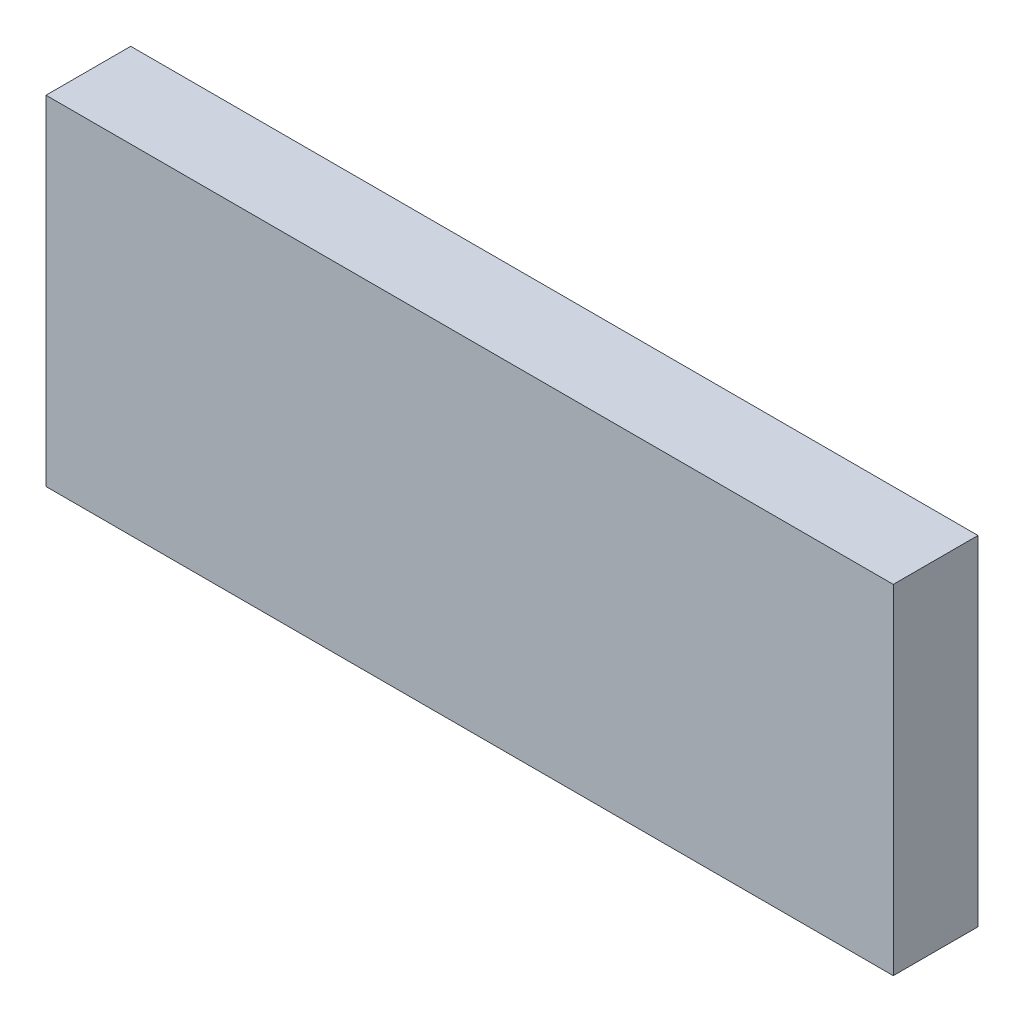
ISO-10303-21;
HEADER;
FILE_DESCRIPTION(('STEP AP214'),'2;1');
FILE_NAME('part.step','',(''),(''),'','','');
FILE_SCHEMA(('AUTOMOTIVE_DESIGN { 1 0 10303 214 1 1 1 1 }'));
ENDSEC;
DATA;
#1=APPLICATION_CONTEXT('core data for automotive mechanical design processes');
#2=APPLICATION_PROTOCOL_DEFINITION('international standard','automotive_design',2000,#1);
#3=PRODUCT_CONTEXT('',#1,'mechanical');
#4=PRODUCT('Part','Part','',(#3));
#5=PRODUCT_RELATED_PRODUCT_CATEGORY('part','',(#4));
#6=PRODUCT_DEFINITION_FORMATION('','',#4);
#7=PRODUCT_DEFINITION_CONTEXT('part definition',#1,'design');
#8=PRODUCT_DEFINITION('design','',#6,#7);
#9=PRODUCT_DEFINITION_SHAPE('','',#8);
#10=(LENGTH_UNIT() NAMED_UNIT(*) SI_UNIT(.MILLI.,.METRE.));
#11=(NAMED_UNIT(*) PLANE_ANGLE_UNIT() SI_UNIT($,.RADIAN.));
#12=(NAMED_UNIT(*) SI_UNIT($,.STERADIAN.) SOLID_ANGLE_UNIT());
#13=UNCERTAINTY_MEASURE_WITH_UNIT(LENGTH_MEASURE(1.E-05),#10,'distance_accuracy_value','');
#14=(GEOMETRIC_REPRESENTATION_CONTEXT(3) GLOBAL_UNCERTAINTY_ASSIGNED_CONTEXT((#13)) GLOBAL_UNIT_ASSIGNED_CONTEXT((#10,
#11,#12)) REPRESENTATION_CONTEXT('',''));
#15=CARTESIAN_POINT('',(0.,0.,0.));
#16=DIRECTION('',(0.,0.,1.));
#17=DIRECTION('',(1.,0.,0.));
#18=AXIS2_PLACEMENT_3D('',#15,#16,#17);
#19=CARTESIAN_POINT('',(50.,20.,10.));
#20=DIRECTION('',(-1.,0.,0.));
#21=DIRECTION('',(0.,0.,1.));
#22=AXIS2_PLACEMENT_3D('',#19,#20,#21);
#23=PLANE('',#22);
#24=DIRECTION('',(0.,1.,0.));
#25=VECTOR('',#24,1.);
#26=CARTESIAN_POINT('',(50.,20.,0.));
#27=LINE('',#26,#25);
#28=CARTESIAN_POINT('',(50.,-20.,0.));
#29=VERTEX_POINT('',#28);
#30=CARTESIAN_POINT('',(50.,20.,0.));
#31=VERTEX_POINT('',#30);
#32=EDGE_CURVE('E97',#29,#31,#27,.T.);
#33=ORIENTED_EDGE('',*,*,#32,.T.);
#34=DIRECTION('',(0.,0.,-1.));
#35=VECTOR('',#34,1.);
#36=CARTESIAN_POINT('',(50.,20.,10.));
#37=LINE('',#36,#35);
#38=CARTESIAN_POINT('',(50.,20.,10.));
#39=VERTEX_POINT('',#38);
#40=EDGE_CURVE('E11',#39,#31,#37,.T.);
#41=ORIENTED_EDGE('',*,*,#40,.F.);
#42=DIRECTION('',(0.,1.,0.));
#43=VECTOR('',#42,1.);
#44=CARTESIAN_POINT('',(50.,20.,10.));
#45=LINE('',#44,#43);
#46=CARTESIAN_POINT('',(50.,-20.,10.));
#47=VERTEX_POINT('',#46);
#48=EDGE_CURVE('E85',#47,#39,#45,.T.);
#49=ORIENTED_EDGE('',*,*,#48,.F.);
#50=DIRECTION('',(0.,0.,-1.));
#51=VECTOR('',#50,1.);
#52=CARTESIAN_POINT('',(50.,-20.,10.));
#53=LINE('',#52,#51);
#54=EDGE_CURVE('E93',#47,#29,#53,.T.);
#55=ORIENTED_EDGE('',*,*,#54,.T.);
#56=EDGE_LOOP('',(#33,#41,#49,#55));
#57=FACE_BOUND('',#56,.T.);
#58=ADVANCED_FACE('F34',(#57),#23,.F.);
#59=CARTESIAN_POINT('',(-50.,20.,10.));
#60=DIRECTION('',(0.,-1.,0.));
#61=DIRECTION('',(0.,0.,-1.));
#62=AXIS2_PLACEMENT_3D('',#59,#60,#61);
#63=PLANE('',#62);
#64=DIRECTION('',(-1.,0.,0.));
#65=VECTOR('',#64,1.);
#66=CARTESIAN_POINT('',(-50.,20.,0.));
#67=LINE('',#66,#65);
#68=CARTESIAN_POINT('',(-50.,20.,0.));
#69=VERTEX_POINT('',#68);
#70=EDGE_CURVE('E89',#31,#69,#67,.T.);
#71=ORIENTED_EDGE('',*,*,#70,.T.);
#72=DIRECTION('',(0.,0.,-1.));
#73=VECTOR('',#72,1.);
#74=CARTESIAN_POINT('',(-50.,20.,10.));
#75=LINE('',#74,#73);
#76=CARTESIAN_POINT('',(-50.,20.,10.));
#77=VERTEX_POINT('',#76);
#78=EDGE_CURVE('E42',#77,#69,#75,.T.);
#79=ORIENTED_EDGE('',*,*,#78,.F.);
#80=DIRECTION('',(-1.,0.,0.));
#81=VECTOR('',#80,1.);
#82=CARTESIAN_POINT('',(-50.,20.,10.));
#83=LINE('',#82,#81);
#84=EDGE_CURVE('E80',#39,#77,#83,.T.);
#85=ORIENTED_EDGE('',*,*,#84,.F.);
#86=ORIENTED_EDGE('',*,*,#40,.T.);
#87=EDGE_LOOP('',(#71,#79,#85,#86));
#88=FACE_BOUND('',#87,.T.);
#89=ADVANCED_FACE('F88',(#88),#63,.F.);
#90=CARTESIAN_POINT('',(-50.,20.,10.));
#91=DIRECTION('',(1.,0.,0.));
#92=DIRECTION('',(0.,1.,0.));
#93=AXIS2_PLACEMENT_3D('',#90,#91,#92);
#94=PLANE('',#93);
#95=DIRECTION('',(0.,-1.,0.));
#96=VECTOR('',#95,1.);
#97=CARTESIAN_POINT('',(-50.,20.,0.));
#98=LINE('',#97,#96);
#99=CARTESIAN_POINT('',(-50.,-20.,0.));
#100=VERTEX_POINT('',#99);
#101=EDGE_CURVE('E67',#69,#100,#98,.T.);
#102=ORIENTED_EDGE('',*,*,#101,.T.);
#103=DIRECTION('',(0.,0.,-1.));
#104=VECTOR('',#103,1.);
#105=CARTESIAN_POINT('',(-50.,-20.,10.));
#106=LINE('',#105,#104);
#107=CARTESIAN_POINT('',(-50.,-20.,10.));
#108=VERTEX_POINT('',#107);
#109=EDGE_CURVE('E90',#108,#100,#106,.T.);
#110=ORIENTED_EDGE('',*,*,#109,.F.);
#111=DIRECTION('',(0.,-1.,0.));
#112=VECTOR('',#111,1.);
#113=CARTESIAN_POINT('',(-50.,20.,10.));
#114=LINE('',#113,#112);
#115=EDGE_CURVE('E83',#77,#108,#114,.T.);
#116=ORIENTED_EDGE('',*,*,#115,.F.);
#117=ORIENTED_EDGE('',*,*,#78,.T.);
#118=EDGE_LOOP('',(#102,#110,#116,#117));
#119=FACE_BOUND('',#118,.T.);
#120=ADVANCED_FACE('F91',(#119),#94,.F.);
#121=CARTESIAN_POINT('',(-50.,-20.,10.));
#122=DIRECTION('',(0.,1.,0.));
#123=DIRECTION('',(0.,0.,1.));
#124=AXIS2_PLACEMENT_3D('',#121,#122,#123);
#125=PLANE('',#124);
#126=DIRECTION('',(1.,0.,0.));
#127=VECTOR('',#126,1.);
#128=CARTESIAN_POINT('',(-50.,-20.,0.));
#129=LINE('',#128,#127);
#130=EDGE_CURVE('E73',#100,#29,#129,.T.);
#131=ORIENTED_EDGE('',*,*,#130,.T.);
#132=ORIENTED_EDGE('',*,*,#54,.F.);
#133=DIRECTION('',(1.,0.,0.));
#134=VECTOR('',#133,1.);
#135=CARTESIAN_POINT('',(-50.,-20.,10.));
#136=LINE('',#135,#134);
#137=EDGE_CURVE('E50',#108,#47,#136,.T.);
#138=ORIENTED_EDGE('',*,*,#137,.F.);
#139=ORIENTED_EDGE('',*,*,#109,.T.);
#140=EDGE_LOOP('',(#131,#132,#138,#139));
#141=FACE_BOUND('',#140,.T.);
#142=ADVANCED_FACE('F104',(#141),#125,.F.);
#143=CARTESIAN_POINT('',(0.,0.,10.));
#144=DIRECTION('',(0.,0.,1.));
#145=DIRECTION('',(1.,0.,0.));
#146=AXIS2_PLACEMENT_3D('',#143,#144,#145);
#147=PLANE('',#146);
#148=ORIENTED_EDGE('',*,*,#48,.T.);
#149=ORIENTED_EDGE('',*,*,#84,.T.);
#150=ORIENTED_EDGE('',*,*,#115,.T.);
#151=ORIENTED_EDGE('',*,*,#137,.T.);
#152=EDGE_LOOP('',(#148,#149,#150,#151));
#153=FACE_BOUND('',#152,.T.);
#154=ADVANCED_FACE('F81',(#153),#147,.T.);
#155=CARTESIAN_POINT('',(0.,0.,0.));
#156=DIRECTION('',(0.,0.,1.));
#157=DIRECTION('',(1.,0.,0.));
#158=AXIS2_PLACEMENT_3D('',#155,#156,#157);
#159=PLANE('',#158);
#160=ORIENTED_EDGE('',*,*,#32,.F.);
#161=ORIENTED_EDGE('',*,*,#130,.F.);
#162=ORIENTED_EDGE('',*,*,#101,.F.);
#163=ORIENTED_EDGE('',*,*,#70,.F.);
#164=EDGE_LOOP('',(#160,#161,#162,#163));
#165=FACE_BOUND('',#164,.T.);
#166=ADVANCED_FACE('F107',(#165),#159,.F.);
#167=CLOSED_SHELL('',(#58,#89,#120,#142,#154,#166));
#168=MANIFOLD_SOLID_BREP('B2',#167);
#169=ADVANCED_BREP_SHAPE_REPRESENTATION('',(#18,#168),#14);
#170=SHAPE_DEFINITION_REPRESENTATION(#9,#169);
ENDSEC;
END-ISO-10303-21;
